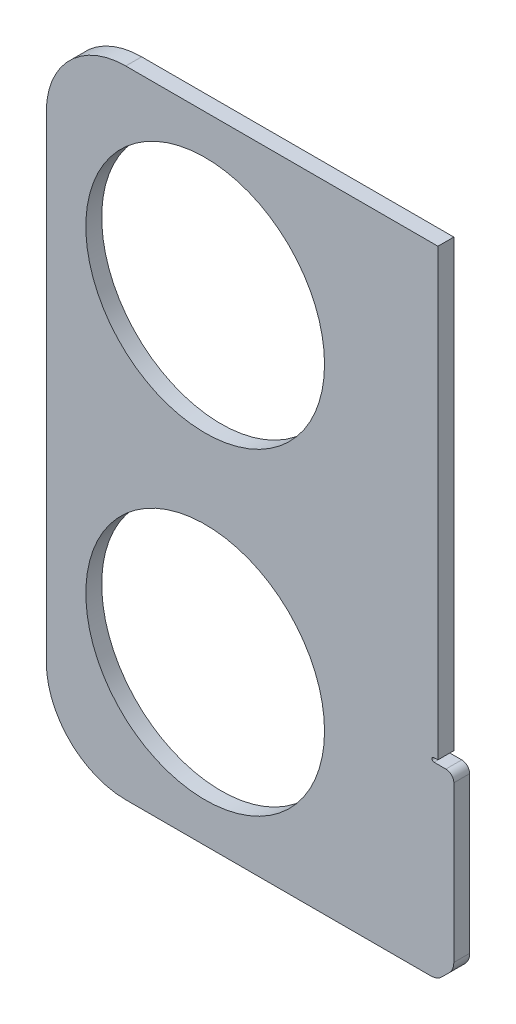
ISO-10303-21;
HEADER;
FILE_DESCRIPTION(('STEP AP214'),'2;1');
FILE_NAME('part.step','',(''),(''),'','','');
FILE_SCHEMA(('AUTOMOTIVE_DESIGN { 1 0 10303 214 1 1 1 1 }'));
ENDSEC;
DATA;
#1=APPLICATION_CONTEXT('core data for automotive mechanical design processes');
#2=APPLICATION_PROTOCOL_DEFINITION('international standard','automotive_design',2000,#1);
#3=PRODUCT_CONTEXT('',#1,'mechanical');
#4=PRODUCT('Part','Part','',(#3));
#5=PRODUCT_RELATED_PRODUCT_CATEGORY('part','',(#4));
#6=PRODUCT_DEFINITION_FORMATION('','',#4);
#7=PRODUCT_DEFINITION_CONTEXT('part definition',#1,'design');
#8=PRODUCT_DEFINITION('design','',#6,#7);
#9=PRODUCT_DEFINITION_SHAPE('','',#8);
#10=(LENGTH_UNIT() NAMED_UNIT(*) SI_UNIT(.MILLI.,.METRE.));
#11=(NAMED_UNIT(*) PLANE_ANGLE_UNIT() SI_UNIT($,.RADIAN.));
#12=(NAMED_UNIT(*) SI_UNIT($,.STERADIAN.) SOLID_ANGLE_UNIT());
#13=UNCERTAINTY_MEASURE_WITH_UNIT(LENGTH_MEASURE(1.E-05),#10,'distance_accuracy_value','');
#14=(GEOMETRIC_REPRESENTATION_CONTEXT(3) GLOBAL_UNCERTAINTY_ASSIGNED_CONTEXT((#13)) GLOBAL_UNIT_ASSIGNED_CONTEXT((#10,
#11,#12)) REPRESENTATION_CONTEXT('',''));
#15=CARTESIAN_POINT('',(0.,0.,0.));
#16=DIRECTION('',(0.,0.,1.));
#17=DIRECTION('',(1.,0.,0.));
#18=AXIS2_PLACEMENT_3D('',#15,#16,#17);
#19=CARTESIAN_POINT('',(18.7,10.,2.));
#20=DIRECTION('',(0.,0.,1.));
#21=DIRECTION('',(1.,0.,0.));
#22=AXIS2_PLACEMENT_3D('',#19,#20,#21);
#23=PLANE('',#22);
#24=CARTESIAN_POINT('',(28.7,60.,2.));
#25=DIRECTION('',(0.,0.,1.));
#26=DIRECTION('',(1.,0.,0.));
#27=AXIS2_PLACEMENT_3D('',#24,#25,#26);
#28=CIRCLE('',#27,15.025);
#29=CARTESIAN_POINT('',(43.725,60.,2.));
#30=VERTEX_POINT('',#29);
#31=EDGE_CURVE('E184',#30,#30,#28,.T.);
#32=ORIENTED_EDGE('',*,*,#31,.F.);
#33=EDGE_LOOP('',(#32));
#34=FACE_BOUND('',#33,.T.);
#35=CARTESIAN_POINT('',(18.7,10.,2.));
#36=DIRECTION('',(0.,0.,1.));
#37=DIRECTION('',(1.,0.,0.));
#38=AXIS2_PLACEMENT_3D('',#35,#36,#37);
#39=CIRCLE('',#38,10.);
#40=CARTESIAN_POINT('',(8.7,10.,2.));
#41=VERTEX_POINT('',#40);
#42=CARTESIAN_POINT('',(18.7,0.,2.));
#43=VERTEX_POINT('',#42);
#44=EDGE_CURVE('E302',#41,#43,#39,.T.);
#45=ORIENTED_EDGE('',*,*,#44,.T.);
#46=DIRECTION('',(1.,0.,0.));
#47=VECTOR('',#46,1.);
#48=CARTESIAN_POINT('',(18.7,0.,2.));
#49=LINE('',#48,#47);
#50=CARTESIAN_POINT('',(57.0857864376269,0.,2.));
#51=VERTEX_POINT('',#50);
#52=EDGE_CURVE('E99',#43,#51,#49,.T.);
#53=ORIENTED_EDGE('',*,*,#52,.T.);
#54=CARTESIAN_POINT('',(57.0857864376269,2.,2.));
#55=DIRECTION('',(0.,0.,1.));
#56=DIRECTION('',(1.,0.,0.));
#57=AXIS2_PLACEMENT_3D('',#54,#55,#56);
#58=CIRCLE('',#57,2.);
#59=CARTESIAN_POINT('',(58.5,0.585786437626896,2.));
#60=VERTEX_POINT('',#59);
#61=EDGE_CURVE('E259',#51,#60,#58,.T.);
#62=ORIENTED_EDGE('',*,*,#61,.T.);
#63=DIRECTION('',(0.707106781186548,0.707106781186547,0.));
#64=VECTOR('',#63,1.);
#65=CARTESIAN_POINT('',(58.5,0.585786437626896,2.));
#66=LINE('',#65,#64);
#67=CARTESIAN_POINT('',(59.4142135623731,1.50000000000002,2.));
#68=VERTEX_POINT('',#67);
#69=EDGE_CURVE('E318',#60,#68,#66,.T.);
#70=ORIENTED_EDGE('',*,*,#69,.T.);
#71=CARTESIAN_POINT('',(58.,2.91421356237312,2.));
#72=DIRECTION('',(0.,0.,1.));
#73=DIRECTION('',(1.,0.,0.));
#74=AXIS2_PLACEMENT_3D('',#71,#72,#73);
#75=CIRCLE('',#74,2.);
#76=CARTESIAN_POINT('',(60.,2.91421356237312,2.));
#77=VERTEX_POINT('',#76);
#78=EDGE_CURVE('E322',#68,#77,#75,.T.);
#79=ORIENTED_EDGE('',*,*,#78,.T.);
#80=DIRECTION('',(0.,1.,0.));
#81=VECTOR('',#80,1.);
#82=CARTESIAN_POINT('',(60.,2.91421356237312,2.));
#83=LINE('',#82,#81);
#84=CARTESIAN_POINT('',(60.,22.5,2.));
#85=VERTEX_POINT('',#84);
#86=EDGE_CURVE('E325',#77,#85,#83,.T.);
#87=ORIENTED_EDGE('',*,*,#86,.T.);
#88=CARTESIAN_POINT('',(59.,22.5,2.));
#89=DIRECTION('',(0.,0.,1.));
#90=DIRECTION('',(1.,0.,0.));
#91=AXIS2_PLACEMENT_3D('',#88,#89,#90);
#92=CIRCLE('',#91,1.);
#93=CARTESIAN_POINT('',(59.,23.5,2.));
#94=VERTEX_POINT('',#93);
#95=EDGE_CURVE('E333',#85,#94,#92,.T.);
#96=ORIENTED_EDGE('',*,*,#95,.T.);
#97=DIRECTION('',(-1.,0.,0.));
#98=VECTOR('',#97,1.);
#99=CARTESIAN_POINT('',(59.,23.5,2.));
#100=LINE('',#99,#98);
#101=CARTESIAN_POINT('',(57.5,23.5,2.));
#102=VERTEX_POINT('',#101);
#103=EDGE_CURVE('E336',#94,#102,#100,.T.);
#104=ORIENTED_EDGE('',*,*,#103,.T.);
#105=CARTESIAN_POINT('',(57.5,23.75,2.));
#106=DIRECTION('',(0.,0.,-1.));
#107=DIRECTION('',(1.,0.,0.));
#108=AXIS2_PLACEMENT_3D('',#105,#106,#107);
#109=CIRCLE('',#108,0.25);
#110=CARTESIAN_POINT('',(57.5,24.,2.));
#111=VERTEX_POINT('',#110);
#112=EDGE_CURVE('E339',#102,#111,#109,.T.);
#113=ORIENTED_EDGE('',*,*,#112,.T.);
#114=DIRECTION('',(1.,0.,0.));
#115=VECTOR('',#114,1.);
#116=CARTESIAN_POINT('',(57.5,24.,2.));
#117=LINE('',#116,#115);
#118=CARTESIAN_POINT('',(58.,24.,2.));
#119=VERTEX_POINT('',#118);
#120=EDGE_CURVE('E343',#111,#119,#117,.T.);
#121=ORIENTED_EDGE('',*,*,#120,.T.);
#122=DIRECTION('',(0.,1.,0.));
#123=VECTOR('',#122,1.);
#124=CARTESIAN_POINT('',(58.,24.,2.));
#125=LINE('',#124,#123);
#126=CARTESIAN_POINT('',(58.,80.,2.));
#127=VERTEX_POINT('',#126);
#128=EDGE_CURVE('E136',#119,#127,#125,.T.);
#129=ORIENTED_EDGE('',*,*,#128,.T.);
#130=DIRECTION('',(-1.,0.,0.));
#131=VECTOR('',#130,1.);
#132=CARTESIAN_POINT('',(58.,80.,2.));
#133=LINE('',#132,#131);
#134=CARTESIAN_POINT('',(18.7,80.,2.));
#135=VERTEX_POINT('',#134);
#136=EDGE_CURVE('E130',#127,#135,#133,.T.);
#137=ORIENTED_EDGE('',*,*,#136,.T.);
#138=CARTESIAN_POINT('',(18.7,70.,2.));
#139=DIRECTION('',(0.,0.,1.));
#140=DIRECTION('',(1.,0.,0.));
#141=AXIS2_PLACEMENT_3D('',#138,#139,#140);
#142=CIRCLE('',#141,10.);
#143=CARTESIAN_POINT('',(8.7,70.,2.));
#144=VERTEX_POINT('',#143);
#145=EDGE_CURVE('E134',#135,#144,#142,.T.);
#146=ORIENTED_EDGE('',*,*,#145,.T.);
#147=DIRECTION('',(0.,-1.,0.));
#148=VECTOR('',#147,1.);
#149=CARTESIAN_POINT('',(8.7,70.,2.));
#150=LINE('',#149,#148);
#151=EDGE_CURVE('E38',#144,#41,#150,.T.);
#152=ORIENTED_EDGE('',*,*,#151,.T.);
#153=EDGE_LOOP('',(#45,#53,#62,#70,#79,#87,#96,#104,#113,#121,#129,#137,#146,#152));
#154=FACE_BOUND('',#153,.T.);
#155=CARTESIAN_POINT('',(28.7,20.,2.));
#156=DIRECTION('',(0.,0.,1.));
#157=DIRECTION('',(1.,0.,0.));
#158=AXIS2_PLACEMENT_3D('',#155,#156,#157);
#159=CIRCLE('',#158,15.025);
#160=CARTESIAN_POINT('',(43.725,20.,2.));
#161=VERTEX_POINT('',#160);
#162=EDGE_CURVE('E173',#161,#161,#159,.T.);
#163=ORIENTED_EDGE('',*,*,#162,.F.);
#164=EDGE_LOOP('',(#163));
#165=FACE_BOUND('',#164,.T.);
#166=ADVANCED_FACE('F19',(#34,#154,#165),#23,.T.);
#167=CARTESIAN_POINT('',(18.7,10.,0.));
#168=DIRECTION('',(0.,0.,1.));
#169=DIRECTION('',(1.,0.,0.));
#170=AXIS2_PLACEMENT_3D('',#167,#168,#169);
#171=PLANE('',#170);
#172=CARTESIAN_POINT('',(18.7,10.,0.));
#173=DIRECTION('',(0.,0.,1.));
#174=DIRECTION('',(1.,0.,0.));
#175=AXIS2_PLACEMENT_3D('',#172,#173,#174);
#176=CIRCLE('',#175,10.);
#177=CARTESIAN_POINT('',(8.7,10.,0.));
#178=VERTEX_POINT('',#177);
#179=CARTESIAN_POINT('',(18.7,0.,0.));
#180=VERTEX_POINT('',#179);
#181=EDGE_CURVE('E275',#178,#180,#176,.T.);
#182=ORIENTED_EDGE('',*,*,#181,.F.);
#183=DIRECTION('',(0.,-1.,0.));
#184=VECTOR('',#183,1.);
#185=CARTESIAN_POINT('',(8.7,70.,0.));
#186=LINE('',#185,#184);
#187=CARTESIAN_POINT('',(8.7,70.,0.));
#188=VERTEX_POINT('',#187);
#189=EDGE_CURVE('E91',#188,#178,#186,.T.);
#190=ORIENTED_EDGE('',*,*,#189,.F.);
#191=CARTESIAN_POINT('',(18.7,70.,0.));
#192=DIRECTION('',(0.,0.,1.));
#193=DIRECTION('',(1.,0.,0.));
#194=AXIS2_PLACEMENT_3D('',#191,#192,#193);
#195=CIRCLE('',#194,10.);
#196=CARTESIAN_POINT('',(18.7,80.,0.));
#197=VERTEX_POINT('',#196);
#198=EDGE_CURVE('E85',#197,#188,#195,.T.);
#199=ORIENTED_EDGE('',*,*,#198,.F.);
#200=DIRECTION('',(-1.,0.,0.));
#201=VECTOR('',#200,1.);
#202=CARTESIAN_POINT('',(58.,80.,0.));
#203=LINE('',#202,#201);
#204=CARTESIAN_POINT('',(58.,80.,0.));
#205=VERTEX_POINT('',#204);
#206=EDGE_CURVE('E145',#205,#197,#203,.T.);
#207=ORIENTED_EDGE('',*,*,#206,.F.);
#208=DIRECTION('',(0.,1.,0.));
#209=VECTOR('',#208,1.);
#210=CARTESIAN_POINT('',(58.,24.,0.));
#211=LINE('',#210,#209);
#212=CARTESIAN_POINT('',(58.,24.,0.));
#213=VERTEX_POINT('',#212);
#214=EDGE_CURVE('E350',#213,#205,#211,.T.);
#215=ORIENTED_EDGE('',*,*,#214,.F.);
#216=DIRECTION('',(1.,0.,0.));
#217=VECTOR('',#216,1.);
#218=CARTESIAN_POINT('',(57.5,24.,0.));
#219=LINE('',#218,#217);
#220=CARTESIAN_POINT('',(57.5,24.,0.));
#221=VERTEX_POINT('',#220);
#222=EDGE_CURVE('E354',#221,#213,#219,.T.);
#223=ORIENTED_EDGE('',*,*,#222,.F.);
#224=CARTESIAN_POINT('',(57.5,23.75,0.));
#225=DIRECTION('',(0.,0.,-1.));
#226=DIRECTION('',(1.,0.,0.));
#227=AXIS2_PLACEMENT_3D('',#224,#225,#226);
#228=CIRCLE('',#227,0.25);
#229=CARTESIAN_POINT('',(57.5,23.5,0.));
#230=VERTEX_POINT('',#229);
#231=EDGE_CURVE('E366',#230,#221,#228,.T.);
#232=ORIENTED_EDGE('',*,*,#231,.F.);
#233=DIRECTION('',(-1.,0.,0.));
#234=VECTOR('',#233,1.);
#235=CARTESIAN_POINT('',(59.,23.5,0.));
#236=LINE('',#235,#234);
#237=CARTESIAN_POINT('',(59.,23.5,0.));
#238=VERTEX_POINT('',#237);
#239=EDGE_CURVE('E369',#238,#230,#236,.T.);
#240=ORIENTED_EDGE('',*,*,#239,.F.);
#241=CARTESIAN_POINT('',(59.,22.5,0.));
#242=DIRECTION('',(0.,0.,1.));
#243=DIRECTION('',(1.,0.,0.));
#244=AXIS2_PLACEMENT_3D('',#241,#242,#243);
#245=CIRCLE('',#244,1.);
#246=CARTESIAN_POINT('',(60.,22.5,0.));
#247=VERTEX_POINT('',#246);
#248=EDGE_CURVE('E372',#247,#238,#245,.T.);
#249=ORIENTED_EDGE('',*,*,#248,.F.);
#250=DIRECTION('',(0.,1.,0.));
#251=VECTOR('',#250,1.);
#252=CARTESIAN_POINT('',(60.,2.91421356237312,0.));
#253=LINE('',#252,#251);
#254=CARTESIAN_POINT('',(60.,2.91421356237312,0.));
#255=VERTEX_POINT('',#254);
#256=EDGE_CURVE('E376',#255,#247,#253,.T.);
#257=ORIENTED_EDGE('',*,*,#256,.F.);
#258=CARTESIAN_POINT('',(58.,2.91421356237312,0.));
#259=DIRECTION('',(0.,0.,1.));
#260=DIRECTION('',(1.,0.,0.));
#261=AXIS2_PLACEMENT_3D('',#258,#259,#260);
#262=CIRCLE('',#261,2.);
#263=CARTESIAN_POINT('',(59.4142135623731,1.50000000000002,0.));
#264=VERTEX_POINT('',#263);
#265=EDGE_CURVE('E272',#264,#255,#262,.T.);
#266=ORIENTED_EDGE('',*,*,#265,.F.);
#267=DIRECTION('',(0.707106781186548,0.707106781186547,0.));
#268=VECTOR('',#267,1.);
#269=CARTESIAN_POINT('',(58.5,0.585786437626896,0.));
#270=LINE('',#269,#268);
#271=CARTESIAN_POINT('',(58.5,0.585786437626896,0.));
#272=VERTEX_POINT('',#271);
#273=EDGE_CURVE('E267',#272,#264,#270,.T.);
#274=ORIENTED_EDGE('',*,*,#273,.F.);
#275=CARTESIAN_POINT('',(57.0857864376269,2.,0.));
#276=DIRECTION('',(0.,0.,1.));
#277=DIRECTION('',(1.,0.,0.));
#278=AXIS2_PLACEMENT_3D('',#275,#276,#277);
#279=CIRCLE('',#278,2.);
#280=CARTESIAN_POINT('',(57.0857864376269,0.,0.));
#281=VERTEX_POINT('',#280);
#282=EDGE_CURVE('E258',#281,#272,#279,.T.);
#283=ORIENTED_EDGE('',*,*,#282,.F.);
#284=DIRECTION('',(1.,0.,0.));
#285=VECTOR('',#284,1.);
#286=CARTESIAN_POINT('',(18.7,0.,0.));
#287=LINE('',#286,#285);
#288=EDGE_CURVE('E265',#180,#281,#287,.T.);
#289=ORIENTED_EDGE('',*,*,#288,.F.);
#290=EDGE_LOOP('',(#182,#190,#199,#207,#215,#223,#232,#240,#249,#257,#266,#274,#283,#289));
#291=FACE_BOUND('',#290,.T.);
#292=CARTESIAN_POINT('',(28.7,60.,0.));
#293=DIRECTION('',(0.,0.,1.));
#294=DIRECTION('',(1.,0.,0.));
#295=AXIS2_PLACEMENT_3D('',#292,#293,#294);
#296=CIRCLE('',#295,15.025);
#297=CARTESIAN_POINT('',(43.725,60.,0.));
#298=VERTEX_POINT('',#297);
#299=EDGE_CURVE('E178',#298,#298,#296,.T.);
#300=ORIENTED_EDGE('',*,*,#299,.T.);
#301=EDGE_LOOP('',(#300));
#302=FACE_BOUND('',#301,.T.);
#303=CARTESIAN_POINT('',(28.7,20.,0.));
#304=DIRECTION('',(0.,0.,1.));
#305=DIRECTION('',(1.,0.,0.));
#306=AXIS2_PLACEMENT_3D('',#303,#304,#305);
#307=CIRCLE('',#306,15.025);
#308=CARTESIAN_POINT('',(43.725,20.,0.));
#309=VERTEX_POINT('',#308);
#310=EDGE_CURVE('E179',#309,#309,#307,.T.);
#311=ORIENTED_EDGE('',*,*,#310,.T.);
#312=EDGE_LOOP('',(#311));
#313=FACE_BOUND('',#312,.T.);
#314=ADVANCED_FACE('F263',(#291,#302,#313),#171,.F.);
#315=CARTESIAN_POINT('',(18.7,10.,2.));
#316=DIRECTION('',(0.,0.,-1.));
#317=DIRECTION('',(-1.,0.,0.));
#318=AXIS2_PLACEMENT_3D('',#315,#316,#317);
#319=CYLINDRICAL_SURFACE('',#318,10.);
#320=ORIENTED_EDGE('',*,*,#181,.T.);
#321=DIRECTION('',(0.,0.,-1.));
#322=VECTOR('',#321,1.);
#323=CARTESIAN_POINT('',(18.7,0.,2.));
#324=LINE('',#323,#322);
#325=EDGE_CURVE('E12',#43,#180,#324,.T.);
#326=ORIENTED_EDGE('',*,*,#325,.F.);
#327=ORIENTED_EDGE('',*,*,#44,.F.);
#328=DIRECTION('',(0.,0.,-1.));
#329=VECTOR('',#328,1.);
#330=CARTESIAN_POINT('',(8.7,10.,2.));
#331=LINE('',#330,#329);
#332=EDGE_CURVE('E157',#41,#178,#331,.T.);
#333=ORIENTED_EDGE('',*,*,#332,.T.);
#334=EDGE_LOOP('',(#320,#326,#327,#333));
#335=FACE_BOUND('',#334,.T.);
#336=ADVANCED_FACE('F21',(#335),#319,.T.);
#337=CARTESIAN_POINT('',(18.7,0.,2.));
#338=DIRECTION('',(0.,1.,0.));
#339=DIRECTION('',(0.,0.,1.));
#340=AXIS2_PLACEMENT_3D('',#337,#338,#339);
#341=PLANE('',#340);
#342=ORIENTED_EDGE('',*,*,#288,.T.);
#343=DIRECTION('',(0.,0.,-1.));
#344=VECTOR('',#343,1.);
#345=CARTESIAN_POINT('',(57.0857864376269,0.,2.));
#346=LINE('',#345,#344);
#347=EDGE_CURVE('E30',#51,#281,#346,.T.);
#348=ORIENTED_EDGE('',*,*,#347,.F.);
#349=ORIENTED_EDGE('',*,*,#52,.F.);
#350=ORIENTED_EDGE('',*,*,#325,.T.);
#351=EDGE_LOOP('',(#342,#348,#349,#350));
#352=FACE_BOUND('',#351,.T.);
#353=ADVANCED_FACE('F566',(#352),#341,.F.);
#354=CARTESIAN_POINT('',(57.0857864376269,2.,2.));
#355=DIRECTION('',(0.,0.,-1.));
#356=DIRECTION('',(-1.,0.,0.));
#357=AXIS2_PLACEMENT_3D('',#354,#355,#356);
#358=CYLINDRICAL_SURFACE('',#357,2.);
#359=ORIENTED_EDGE('',*,*,#282,.T.);
#360=DIRECTION('',(0.,0.,-1.));
#361=VECTOR('',#360,1.);
#362=CARTESIAN_POINT('',(58.5,0.585786437626896,2.));
#363=LINE('',#362,#361);
#364=EDGE_CURVE('E245',#60,#272,#363,.T.);
#365=ORIENTED_EDGE('',*,*,#364,.F.);
#366=ORIENTED_EDGE('',*,*,#61,.F.);
#367=ORIENTED_EDGE('',*,*,#347,.T.);
#368=EDGE_LOOP('',(#359,#365,#366,#367));
#369=FACE_BOUND('',#368,.T.);
#370=ADVANCED_FACE('F256',(#369),#358,.T.);
#371=CARTESIAN_POINT('',(58.5,0.585786437626896,2.));
#372=DIRECTION('',(-0.707106781186547,0.707106781186548,0.));
#373=DIRECTION('',(-0.707106781186548,-0.707106781186547,0.));
#374=AXIS2_PLACEMENT_3D('',#371,#372,#373);
#375=PLANE('',#374);
#376=ORIENTED_EDGE('',*,*,#273,.T.);
#377=DIRECTION('',(0.,0.,-1.));
#378=VECTOR('',#377,1.);
#379=CARTESIAN_POINT('',(59.4142135623731,1.50000000000002,2.));
#380=LINE('',#379,#378);
#381=EDGE_CURVE('E240',#68,#264,#380,.T.);
#382=ORIENTED_EDGE('',*,*,#381,.F.);
#383=ORIENTED_EDGE('',*,*,#69,.F.);
#384=ORIENTED_EDGE('',*,*,#364,.T.);
#385=EDGE_LOOP('',(#376,#382,#383,#384));
#386=FACE_BOUND('',#385,.T.);
#387=ADVANCED_FACE('F416',(#386),#375,.F.);
#388=CARTESIAN_POINT('',(58.,2.91421356237312,2.));
#389=DIRECTION('',(0.,0.,-1.));
#390=DIRECTION('',(-1.,0.,0.));
#391=AXIS2_PLACEMENT_3D('',#388,#389,#390);
#392=CYLINDRICAL_SURFACE('',#391,2.);
#393=ORIENTED_EDGE('',*,*,#265,.T.);
#394=DIRECTION('',(0.,0.,-1.));
#395=VECTOR('',#394,1.);
#396=CARTESIAN_POINT('',(60.,2.91421356237312,2.));
#397=LINE('',#396,#395);
#398=EDGE_CURVE('E235',#77,#255,#397,.T.);
#399=ORIENTED_EDGE('',*,*,#398,.F.);
#400=ORIENTED_EDGE('',*,*,#78,.F.);
#401=ORIENTED_EDGE('',*,*,#381,.T.);
#402=EDGE_LOOP('',(#393,#399,#400,#401));
#403=FACE_BOUND('',#402,.T.);
#404=ADVANCED_FACE('F414',(#403),#392,.T.);
#405=CARTESIAN_POINT('',(60.,2.91421356237312,2.));
#406=DIRECTION('',(-1.,0.,0.));
#407=DIRECTION('',(0.,-1.,0.));
#408=AXIS2_PLACEMENT_3D('',#405,#406,#407);
#409=PLANE('',#408);
#410=ORIENTED_EDGE('',*,*,#256,.T.);
#411=DIRECTION('',(0.,0.,-1.));
#412=VECTOR('',#411,1.);
#413=CARTESIAN_POINT('',(60.,22.5,2.));
#414=LINE('',#413,#412);
#415=EDGE_CURVE('E231',#85,#247,#414,.T.);
#416=ORIENTED_EDGE('',*,*,#415,.F.);
#417=ORIENTED_EDGE('',*,*,#86,.F.);
#418=ORIENTED_EDGE('',*,*,#398,.T.);
#419=EDGE_LOOP('',(#410,#416,#417,#418));
#420=FACE_BOUND('',#419,.T.);
#421=ADVANCED_FACE('F387',(#420),#409,.F.);
#422=CARTESIAN_POINT('',(59.,22.5,2.));
#423=DIRECTION('',(0.,0.,-1.));
#424=DIRECTION('',(-1.,0.,0.));
#425=AXIS2_PLACEMENT_3D('',#422,#423,#424);
#426=CYLINDRICAL_SURFACE('',#425,1.);
#427=ORIENTED_EDGE('',*,*,#248,.T.);
#428=DIRECTION('',(0.,0.,-1.));
#429=VECTOR('',#428,1.);
#430=CARTESIAN_POINT('',(59.,23.5,2.));
#431=LINE('',#430,#429);
#432=EDGE_CURVE('E223',#94,#238,#431,.T.);
#433=ORIENTED_EDGE('',*,*,#432,.F.);
#434=ORIENTED_EDGE('',*,*,#95,.F.);
#435=ORIENTED_EDGE('',*,*,#415,.T.);
#436=EDGE_LOOP('',(#427,#433,#434,#435));
#437=FACE_BOUND('',#436,.T.);
#438=ADVANCED_FACE('F392',(#437),#426,.T.);
#439=CARTESIAN_POINT('',(59.,23.5,2.));
#440=DIRECTION('',(0.,-1.,0.));
#441=DIRECTION('',(1.,0.,0.));
#442=AXIS2_PLACEMENT_3D('',#439,#440,#441);
#443=PLANE('',#442);
#444=ORIENTED_EDGE('',*,*,#239,.T.);
#445=DIRECTION('',(0.,0.,-1.));
#446=VECTOR('',#445,1.);
#447=CARTESIAN_POINT('',(57.5,23.5,2.));
#448=LINE('',#447,#446);
#449=EDGE_CURVE('E218',#102,#230,#448,.T.);
#450=ORIENTED_EDGE('',*,*,#449,.F.);
#451=ORIENTED_EDGE('',*,*,#103,.F.);
#452=ORIENTED_EDGE('',*,*,#432,.T.);
#453=EDGE_LOOP('',(#444,#450,#451,#452));
#454=FACE_BOUND('',#453,.T.);
#455=ADVANCED_FACE('F400',(#454),#443,.F.);
#456=CARTESIAN_POINT('',(57.5,23.75,2.));
#457=DIRECTION('',(0.,0.,-1.));
#458=DIRECTION('',(-1.,0.,0.));
#459=AXIS2_PLACEMENT_3D('',#456,#457,#458);
#460=CYLINDRICAL_SURFACE('',#459,0.25);
#461=ORIENTED_EDGE('',*,*,#231,.T.);
#462=DIRECTION('',(0.,0.,-1.));
#463=VECTOR('',#462,1.);
#464=CARTESIAN_POINT('',(57.5,24.,2.));
#465=LINE('',#464,#463);
#466=EDGE_CURVE('E214',#111,#221,#465,.T.);
#467=ORIENTED_EDGE('',*,*,#466,.F.);
#468=ORIENTED_EDGE('',*,*,#112,.F.);
#469=ORIENTED_EDGE('',*,*,#449,.T.);
#470=EDGE_LOOP('',(#461,#467,#468,#469));
#471=FACE_BOUND('',#470,.T.);
#472=ADVANCED_FACE('F404',(#471),#460,.F.);
#473=CARTESIAN_POINT('',(57.5,24.,2.));
#474=DIRECTION('',(0.,1.,0.));
#475=DIRECTION('',(0.,0.,1.));
#476=AXIS2_PLACEMENT_3D('',#473,#474,#475);
#477=PLANE('',#476);
#478=ORIENTED_EDGE('',*,*,#222,.T.);
#479=DIRECTION('',(0.,0.,-1.));
#480=VECTOR('',#479,1.);
#481=CARTESIAN_POINT('',(58.,24.,2.));
#482=LINE('',#481,#480);
#483=EDGE_CURVE('E210',#119,#213,#482,.T.);
#484=ORIENTED_EDGE('',*,*,#483,.F.);
#485=ORIENTED_EDGE('',*,*,#120,.F.);
#486=ORIENTED_EDGE('',*,*,#466,.T.);
#487=EDGE_LOOP('',(#478,#484,#485,#486));
#488=FACE_BOUND('',#487,.T.);
#489=ADVANCED_FACE('F447',(#488),#477,.F.);
#490=CARTESIAN_POINT('',(58.,24.,2.));
#491=DIRECTION('',(-1.,0.,0.));
#492=DIRECTION('',(0.,0.,1.));
#493=AXIS2_PLACEMENT_3D('',#490,#491,#492);
#494=PLANE('',#493);
#495=ORIENTED_EDGE('',*,*,#214,.T.);
#496=DIRECTION('',(0.,0.,-1.));
#497=VECTOR('',#496,1.);
#498=CARTESIAN_POINT('',(58.,80.,2.));
#499=LINE('',#498,#497);
#500=EDGE_CURVE('E147',#127,#205,#499,.T.);
#501=ORIENTED_EDGE('',*,*,#500,.F.);
#502=ORIENTED_EDGE('',*,*,#128,.F.);
#503=ORIENTED_EDGE('',*,*,#483,.T.);
#504=EDGE_LOOP('',(#495,#501,#502,#503));
#505=FACE_BOUND('',#504,.T.);
#506=ADVANCED_FACE('F444',(#505),#494,.F.);
#507=CARTESIAN_POINT('',(58.,80.,2.));
#508=DIRECTION('',(0.,-1.,0.));
#509=DIRECTION('',(1.,0.,0.));
#510=AXIS2_PLACEMENT_3D('',#507,#508,#509);
#511=PLANE('',#510);
#512=ORIENTED_EDGE('',*,*,#206,.T.);
#513=DIRECTION('',(0.,0.,-1.));
#514=VECTOR('',#513,1.);
#515=CARTESIAN_POINT('',(18.7,80.,2.));
#516=LINE('',#515,#514);
#517=EDGE_CURVE('E142',#135,#197,#516,.T.);
#518=ORIENTED_EDGE('',*,*,#517,.F.);
#519=ORIENTED_EDGE('',*,*,#136,.F.);
#520=ORIENTED_EDGE('',*,*,#500,.T.);
#521=EDGE_LOOP('',(#512,#518,#519,#520));
#522=FACE_BOUND('',#521,.T.);
#523=ADVANCED_FACE('F143',(#522),#511,.F.);
#524=CARTESIAN_POINT('',(18.7,70.,2.));
#525=DIRECTION('',(0.,0.,-1.));
#526=DIRECTION('',(-1.,0.,0.));
#527=AXIS2_PLACEMENT_3D('',#524,#525,#526);
#528=CYLINDRICAL_SURFACE('',#527,10.);
#529=ORIENTED_EDGE('',*,*,#198,.T.);
#530=DIRECTION('',(0.,0.,-1.));
#531=VECTOR('',#530,1.);
#532=CARTESIAN_POINT('',(8.7,70.,2.));
#533=LINE('',#532,#531);
#534=EDGE_CURVE('E148',#144,#188,#533,.T.);
#535=ORIENTED_EDGE('',*,*,#534,.F.);
#536=ORIENTED_EDGE('',*,*,#145,.F.);
#537=ORIENTED_EDGE('',*,*,#517,.T.);
#538=EDGE_LOOP('',(#529,#535,#536,#537));
#539=FACE_BOUND('',#538,.T.);
#540=ADVANCED_FACE('F150',(#539),#528,.T.);
#541=CARTESIAN_POINT('',(8.7,70.,2.));
#542=DIRECTION('',(1.,0.,0.));
#543=DIRECTION('',(0.,1.,0.));
#544=AXIS2_PLACEMENT_3D('',#541,#542,#543);
#545=PLANE('',#544);
#546=ORIENTED_EDGE('',*,*,#189,.T.);
#547=ORIENTED_EDGE('',*,*,#332,.F.);
#548=ORIENTED_EDGE('',*,*,#151,.F.);
#549=ORIENTED_EDGE('',*,*,#534,.T.);
#550=EDGE_LOOP('',(#546,#547,#548,#549));
#551=FACE_BOUND('',#550,.T.);
#552=ADVANCED_FACE('F437',(#551),#545,.F.);
#553=CARTESIAN_POINT('',(28.7,60.,2.));
#554=DIRECTION('',(0.,0.,-1.));
#555=DIRECTION('',(-1.,0.,0.));
#556=AXIS2_PLACEMENT_3D('',#553,#554,#555);
#557=CYLINDRICAL_SURFACE('',#556,15.025);
#558=ORIENTED_EDGE('',*,*,#31,.T.);
#559=EDGE_LOOP('',(#558));
#560=FACE_BOUND('',#559,.T.);
#561=ORIENTED_EDGE('',*,*,#299,.F.);
#562=EDGE_LOOP('',(#561));
#563=FACE_BOUND('',#562,.T.);
#564=ADVANCED_FACE('F434',(#560,#563),#557,.F.);
#565=CARTESIAN_POINT('',(28.7,20.,2.));
#566=DIRECTION('',(0.,0.,-1.));
#567=DIRECTION('',(-1.,0.,0.));
#568=AXIS2_PLACEMENT_3D('',#565,#566,#567);
#569=CYLINDRICAL_SURFACE('',#568,15.025);
#570=ORIENTED_EDGE('',*,*,#162,.T.);
#571=EDGE_LOOP('',(#570));
#572=FACE_BOUND('',#571,.T.);
#573=ORIENTED_EDGE('',*,*,#310,.F.);
#574=EDGE_LOOP('',(#573));
#575=FACE_BOUND('',#574,.T.);
#576=ADVANCED_FACE('F489',(#572,#575),#569,.F.);
#577=CLOSED_SHELL('',(#166,#314,#336,#353,#370,#387,#404,#421,#438,#455,#472,#489,#506,#523,
#540,#552,#564,#576));
#578=MANIFOLD_SOLID_BREP('B1',#577);
#579=ADVANCED_BREP_SHAPE_REPRESENTATION('',(#18,#578),#14);
#580=SHAPE_DEFINITION_REPRESENTATION(#9,#579);
ENDSEC;
END-ISO-10303-21;
